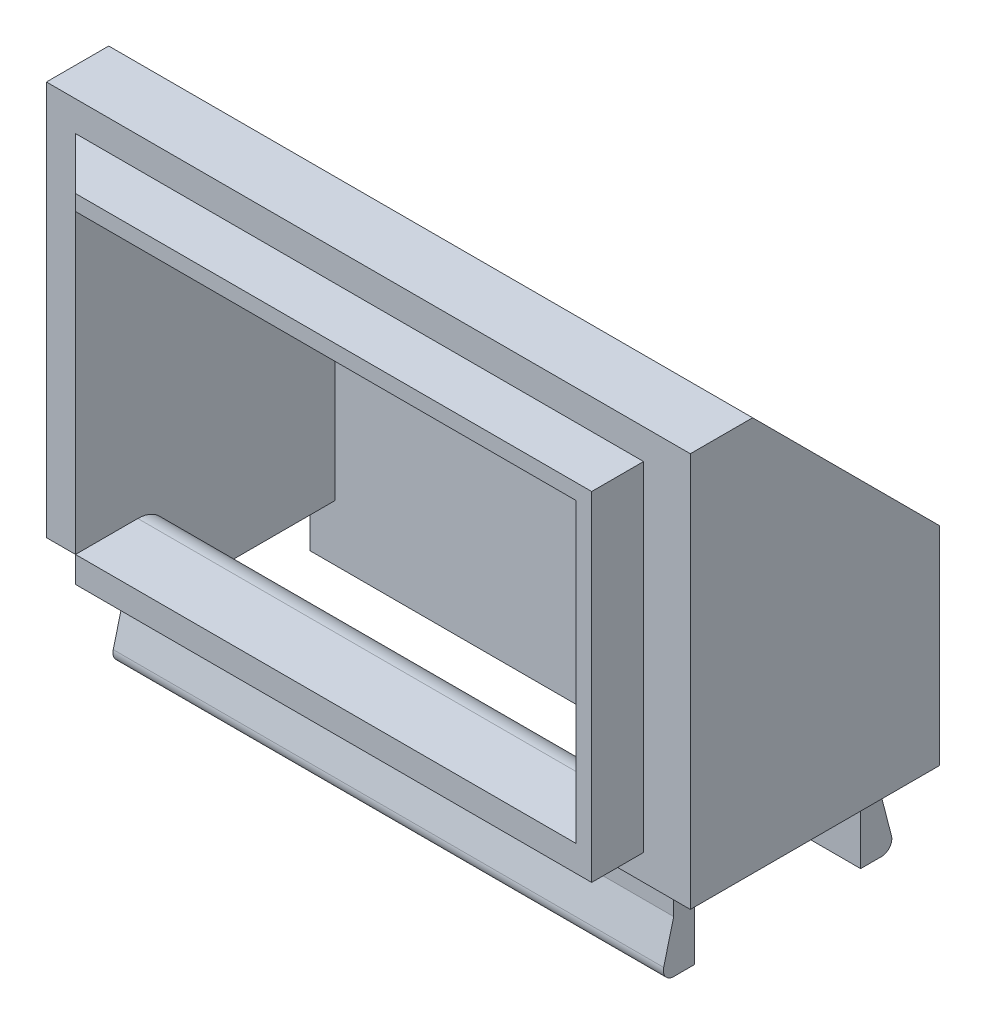
ISO-10303-21;
HEADER;
FILE_DESCRIPTION(('STEP AP214'),'2;1');
FILE_NAME('part.step','',(''),(''),'','','');
FILE_SCHEMA(('AUTOMOTIVE_DESIGN { 1 0 10303 214 1 1 1 1 }'));
ENDSEC;
DATA;
#1=APPLICATION_CONTEXT('core data for automotive mechanical design processes');
#2=APPLICATION_PROTOCOL_DEFINITION('international standard','automotive_design',2000,#1);
#3=PRODUCT_CONTEXT('',#1,'mechanical');
#4=PRODUCT('Part','Part','',(#3));
#5=PRODUCT_RELATED_PRODUCT_CATEGORY('part','',(#4));
#6=PRODUCT_DEFINITION_FORMATION('','',#4);
#7=PRODUCT_DEFINITION_CONTEXT('part definition',#1,'design');
#8=PRODUCT_DEFINITION('design','',#6,#7);
#9=PRODUCT_DEFINITION_SHAPE('','',#8);
#10=(LENGTH_UNIT() NAMED_UNIT(*) SI_UNIT(.MILLI.,.METRE.));
#11=(NAMED_UNIT(*) PLANE_ANGLE_UNIT() SI_UNIT($,.RADIAN.));
#12=(NAMED_UNIT(*) SI_UNIT($,.STERADIAN.) SOLID_ANGLE_UNIT());
#13=UNCERTAINTY_MEASURE_WITH_UNIT(LENGTH_MEASURE(1.E-05),#10,'distance_accuracy_value','');
#14=(GEOMETRIC_REPRESENTATION_CONTEXT(3) GLOBAL_UNCERTAINTY_ASSIGNED_CONTEXT((#13)) GLOBAL_UNIT_ASSIGNED_CONTEXT((#10,
#11,#12)) REPRESENTATION_CONTEXT('',''));
#15=CARTESIAN_POINT('',(0.,0.,0.));
#16=DIRECTION('',(0.,0.,1.));
#17=DIRECTION('',(1.,0.,0.));
#18=AXIS2_PLACEMENT_3D('',#15,#16,#17);
#19=CARTESIAN_POINT('',(-15.5,19.,6.));
#20=DIRECTION('',(0.,0.,-1.));
#21=DIRECTION('',(-1.,0.,0.));
#22=AXIS2_PLACEMENT_3D('',#19,#20,#21);
#23=PLANE('',#22);
#24=DIRECTION('',(1.,0.,0.));
#25=VECTOR('',#24,1.);
#26=CARTESIAN_POINT('',(-15.5,0.,6.));
#27=LINE('',#26,#25);
#28=CARTESIAN_POINT('',(-15.5,0.,6.));
#29=VERTEX_POINT('',#28);
#30=CARTESIAN_POINT('',(15.5,0.,6.));
#31=VERTEX_POINT('',#30);
#32=EDGE_CURVE('E438',#29,#31,#27,.T.);
#33=ORIENTED_EDGE('',*,*,#32,.T.);
#34=DIRECTION('',(0.,-1.,0.));
#35=VECTOR('',#34,1.);
#36=CARTESIAN_POINT('',(15.5,19.,6.));
#37=LINE('',#36,#35);
#38=CARTESIAN_POINT('',(15.5,19.,6.));
#39=VERTEX_POINT('',#38);
#40=EDGE_CURVE('E442',#39,#31,#37,.T.);
#41=ORIENTED_EDGE('',*,*,#40,.F.);
#42=DIRECTION('',(1.,0.,0.));
#43=VECTOR('',#42,1.);
#44=CARTESIAN_POINT('',(-15.5,19.,6.));
#45=LINE('',#44,#43);
#46=CARTESIAN_POINT('',(-15.5,19.,6.));
#47=VERTEX_POINT('',#46);
#48=EDGE_CURVE('E440',#47,#39,#45,.T.);
#49=ORIENTED_EDGE('',*,*,#48,.F.);
#50=DIRECTION('',(0.,-1.,0.));
#51=VECTOR('',#50,1.);
#52=CARTESIAN_POINT('',(-15.5,19.,6.));
#53=LINE('',#52,#51);
#54=EDGE_CURVE('E453',#47,#29,#53,.T.);
#55=ORIENTED_EDGE('',*,*,#54,.T.);
#56=EDGE_LOOP('',(#33,#41,#49,#55));
#57=FACE_BOUND('',#56,.T.);
#58=DIRECTION('',(0.,-1.,0.));
#59=VECTOR('',#58,1.);
#60=CARTESIAN_POINT('',(-14.1,17.55,6.));
#61=LINE('',#60,#59);
#62=CARTESIAN_POINT('',(-14.1,17.55,6.));
#63=VERTEX_POINT('',#62);
#64=CARTESIAN_POINT('',(-14.1,1.25,6.));
#65=VERTEX_POINT('',#64);
#66=EDGE_CURVE('E306',#63,#65,#61,.T.);
#67=ORIENTED_EDGE('',*,*,#66,.F.);
#68=DIRECTION('',(-1.,0.,0.));
#69=VECTOR('',#68,1.);
#70=CARTESIAN_POINT('',(-14.1,17.55,6.));
#71=LINE('',#70,#69);
#72=CARTESIAN_POINT('',(13.25,17.55,6.));
#73=VERTEX_POINT('',#72);
#74=EDGE_CURVE('E294',#73,#63,#71,.T.);
#75=ORIENTED_EDGE('',*,*,#74,.F.);
#76=DIRECTION('',(0.,1.,0.));
#77=VECTOR('',#76,1.);
#78=CARTESIAN_POINT('',(13.25,17.55,6.));
#79=LINE('',#78,#77);
#80=CARTESIAN_POINT('',(13.25,1.25,6.));
#81=VERTEX_POINT('',#80);
#82=EDGE_CURVE('E312',#81,#73,#79,.T.);
#83=ORIENTED_EDGE('',*,*,#82,.F.);
#84=DIRECTION('',(1.,0.,0.));
#85=VECTOR('',#84,1.);
#86=CARTESIAN_POINT('',(-14.1,1.25,6.));
#87=LINE('',#86,#85);
#88=EDGE_CURVE('E308',#65,#81,#87,.T.);
#89=ORIENTED_EDGE('',*,*,#88,.F.);
#90=EDGE_LOOP('',(#67,#75,#83,#89));
#91=FACE_BOUND('',#90,.T.);
#92=ADVANCED_FACE('F49',(#57,#91),#23,.F.);
#93=CARTESIAN_POINT('',(0.,0.,0.));
#94=DIRECTION('',(0.,-1.,0.));
#95=DIRECTION('',(0.,0.,-1.));
#96=AXIS2_PLACEMENT_3D('',#93,#94,#95);
#97=PLANE('',#96);
#98=DIRECTION('',(0.,0.,-1.));
#99=VECTOR('',#98,1.);
#100=CARTESIAN_POINT('',(15.5,0.,6.));
#101=LINE('',#100,#99);
#102=CARTESIAN_POINT('',(15.5,0.,-6.));
#103=VERTEX_POINT('',#102);
#104=EDGE_CURVE('E428',#31,#103,#101,.T.);
#105=ORIENTED_EDGE('',*,*,#104,.F.);
#106=ORIENTED_EDGE('',*,*,#32,.F.);
#107=DIRECTION('',(0.,0.,1.));
#108=VECTOR('',#107,1.);
#109=CARTESIAN_POINT('',(-15.5,0.,6.));
#110=LINE('',#109,#108);
#111=CARTESIAN_POINT('',(-15.5,0.,-6.));
#112=VERTEX_POINT('',#111);
#113=EDGE_CURVE('E448',#112,#29,#110,.T.);
#114=ORIENTED_EDGE('',*,*,#113,.F.);
#115=DIRECTION('',(-1.,0.,0.));
#116=VECTOR('',#115,1.);
#117=CARTESIAN_POINT('',(-15.5,0.,-6.));
#118=LINE('',#117,#116);
#119=EDGE_CURVE('E445',#103,#112,#118,.T.);
#120=ORIENTED_EDGE('',*,*,#119,.F.);
#121=EDGE_LOOP('',(#105,#106,#114,#120));
#122=FACE_BOUND('',#121,.T.);
#123=DIRECTION('',(0.,0.,1.));
#124=VECTOR('',#123,1.);
#125=CARTESIAN_POINT('',(13.7,0.,5.));
#126=LINE('',#125,#124);
#127=CARTESIAN_POINT('',(13.7,0.,-5.));
#128=VERTEX_POINT('',#127);
#129=CARTESIAN_POINT('',(13.7,0.,5.));
#130=VERTEX_POINT('',#129);
#131=EDGE_CURVE('E408',#128,#130,#126,.T.);
#132=ORIENTED_EDGE('',*,*,#131,.F.);
#133=DIRECTION('',(1.,0.,0.));
#134=VECTOR('',#133,1.);
#135=CARTESIAN_POINT('',(-12.8,0.,-5.));
#136=LINE('',#135,#134);
#137=CARTESIAN_POINT('',(-12.8,0.,-5.));
#138=VERTEX_POINT('',#137);
#139=EDGE_CURVE('E381',#138,#128,#136,.T.);
#140=ORIENTED_EDGE('',*,*,#139,.F.);
#141=DIRECTION('',(0.,0.,-1.));
#142=VECTOR('',#141,1.);
#143=CARTESIAN_POINT('',(-12.8,0.,5.));
#144=LINE('',#143,#142);
#145=CARTESIAN_POINT('',(-12.8,0.,5.));
#146=VERTEX_POINT('',#145);
#147=EDGE_CURVE('E384',#146,#138,#144,.T.);
#148=ORIENTED_EDGE('',*,*,#147,.F.);
#149=DIRECTION('',(-1.,0.,0.));
#150=VECTOR('',#149,1.);
#151=CARTESIAN_POINT('',(-12.8,0.,5.));
#152=LINE('',#151,#150);
#153=EDGE_CURVE('E398',#130,#146,#152,.T.);
#154=ORIENTED_EDGE('',*,*,#153,.F.);
#155=EDGE_LOOP('',(#132,#140,#148,#154));
#156=FACE_BOUND('',#155,.T.);
#157=ADVANCED_FACE('F500',(#122,#156),#97,.T.);
#158=CARTESIAN_POINT('',(-11.6,16.8,4.));
#159=DIRECTION('',(0.,0.,1.));
#160=DIRECTION('',(1.,0.,0.));
#161=AXIS2_PLACEMENT_3D('',#158,#159,#160);
#162=PLANE('',#161);
#163=DIRECTION('',(0.,-1.,0.));
#164=VECTOR('',#163,1.);
#165=CARTESIAN_POINT('',(-11.6,16.8,4.));
#166=LINE('',#165,#164);
#167=CARTESIAN_POINT('',(-11.6,1.,4.));
#168=VERTEX_POINT('',#167);
#169=CARTESIAN_POINT('',(-11.6,-1.5,4.));
#170=VERTEX_POINT('',#169);
#171=EDGE_CURVE('E426',#168,#170,#166,.T.);
#172=ORIENTED_EDGE('',*,*,#171,.F.);
#173=DIRECTION('',(-1.,0.,0.));
#174=VECTOR('',#173,1.);
#175=CARTESIAN_POINT('',(-11.6,1.,4.));
#176=LINE('',#175,#174);
#177=CARTESIAN_POINT('',(12.5,1.,4.));
#178=VERTEX_POINT('',#177);
#179=EDGE_CURVE('E70',#168,#178,#176,.F.);
#180=ORIENTED_EDGE('',*,*,#179,.T.);
#181=DIRECTION('',(0.,-1.,0.));
#182=VECTOR('',#181,1.);
#183=CARTESIAN_POINT('',(12.5,16.8,4.));
#184=LINE('',#183,#182);
#185=CARTESIAN_POINT('',(12.5,-1.5,4.));
#186=VERTEX_POINT('',#185);
#187=EDGE_CURVE('E429',#178,#186,#184,.T.);
#188=ORIENTED_EDGE('',*,*,#187,.T.);
#189=DIRECTION('',(-1.,0.,0.));
#190=VECTOR('',#189,1.);
#191=CARTESIAN_POINT('',(12.5,-1.5,4.));
#192=LINE('',#191,#190);
#193=CARTESIAN_POINT('',(13.7,-1.5,4.));
#194=VERTEX_POINT('',#193);
#195=EDGE_CURVE('E318',#194,#186,#192,.T.);
#196=ORIENTED_EDGE('',*,*,#195,.F.);
#197=DIRECTION('',(0.,1.,0.));
#198=VECTOR('',#197,1.);
#199=CARTESIAN_POINT('',(13.7,-4.2,4.));
#200=LINE('',#199,#198);
#201=CARTESIAN_POINT('',(13.7,-4.2,4.));
#202=VERTEX_POINT('',#201);
#203=EDGE_CURVE('E416',#202,#194,#200,.T.);
#204=ORIENTED_EDGE('',*,*,#203,.F.);
#205=DIRECTION('',(1.,0.,0.));
#206=VECTOR('',#205,1.);
#207=CARTESIAN_POINT('',(-12.8,-4.2,4.));
#208=LINE('',#207,#206);
#209=CARTESIAN_POINT('',(-12.8,-4.2,4.));
#210=VERTEX_POINT('',#209);
#211=EDGE_CURVE('E397',#210,#202,#208,.T.);
#212=ORIENTED_EDGE('',*,*,#211,.F.);
#213=DIRECTION('',(0.,1.,0.));
#214=VECTOR('',#213,1.);
#215=CARTESIAN_POINT('',(-12.8,-4.2,4.));
#216=LINE('',#215,#214);
#217=CARTESIAN_POINT('',(-12.8,-1.5,4.));
#218=VERTEX_POINT('',#217);
#219=EDGE_CURVE('E248',#210,#218,#216,.T.);
#220=ORIENTED_EDGE('',*,*,#219,.T.);
#221=DIRECTION('',(-1.,0.,0.));
#222=VECTOR('',#221,1.);
#223=CARTESIAN_POINT('',(-11.6,-1.5,4.));
#224=LINE('',#223,#222);
#225=EDGE_CURVE('E333',#170,#218,#224,.T.);
#226=ORIENTED_EDGE('',*,*,#225,.F.);
#227=EDGE_LOOP('',(#172,#180,#188,#196,#204,#212,#220,#226));
#228=FACE_BOUND('',#227,.T.);
#229=ADVANCED_FACE('F503',(#228),#162,.F.);
#230=CARTESIAN_POINT('',(-11.6,16.8,-4.));
#231=DIRECTION('',(0.,0.,-1.));
#232=DIRECTION('',(-1.,0.,0.));
#233=AXIS2_PLACEMENT_3D('',#230,#231,#232);
#234=PLANE('',#233);
#235=DIRECTION('',(1.,0.,0.));
#236=VECTOR('',#235,1.);
#237=CARTESIAN_POINT('',(12.5,-1.5,-4.));
#238=LINE('',#237,#236);
#239=CARTESIAN_POINT('',(12.5,-1.5,-4.));
#240=VERTEX_POINT('',#239);
#241=CARTESIAN_POINT('',(13.7,-1.5,-4.));
#242=VERTEX_POINT('',#241);
#243=EDGE_CURVE('E324',#240,#242,#238,.T.);
#244=ORIENTED_EDGE('',*,*,#243,.F.);
#245=DIRECTION('',(0.,-1.,0.));
#246=VECTOR('',#245,1.);
#247=CARTESIAN_POINT('',(12.5,16.8,-4.));
#248=LINE('',#247,#246);
#249=CARTESIAN_POINT('',(12.5,8.8,-4.));
#250=VERTEX_POINT('',#249);
#251=EDGE_CURVE('E431',#250,#240,#248,.T.);
#252=ORIENTED_EDGE('',*,*,#251,.F.);
#253=DIRECTION('',(-1.,0.,0.));
#254=VECTOR('',#253,1.);
#255=CARTESIAN_POINT('',(-11.6,8.8,-4.));
#256=LINE('',#255,#254);
#257=CARTESIAN_POINT('',(-11.6,8.8,-4.));
#258=VERTEX_POINT('',#257);
#259=EDGE_CURVE('E465',#250,#258,#256,.T.);
#260=ORIENTED_EDGE('',*,*,#259,.T.);
#261=DIRECTION('',(0.,-1.,0.));
#262=VECTOR('',#261,1.);
#263=CARTESIAN_POINT('',(-11.6,16.8,-4.));
#264=LINE('',#263,#262);
#265=CARTESIAN_POINT('',(-11.6,-1.5,-4.));
#266=VERTEX_POINT('',#265);
#267=EDGE_CURVE('E425',#258,#266,#264,.T.);
#268=ORIENTED_EDGE('',*,*,#267,.T.);
#269=DIRECTION('',(1.,0.,0.));
#270=VECTOR('',#269,1.);
#271=CARTESIAN_POINT('',(-11.6,-1.5,-4.));
#272=LINE('',#271,#270);
#273=CARTESIAN_POINT('',(-12.8,-1.5,-4.));
#274=VERTEX_POINT('',#273);
#275=EDGE_CURVE('E337',#274,#266,#272,.T.);
#276=ORIENTED_EDGE('',*,*,#275,.F.);
#277=DIRECTION('',(0.,1.,0.));
#278=VECTOR('',#277,1.);
#279=CARTESIAN_POINT('',(-12.8,-4.2,-4.));
#280=LINE('',#279,#278);
#281=CARTESIAN_POINT('',(-12.8,-4.2,-4.));
#282=VERTEX_POINT('',#281);
#283=EDGE_CURVE('E377',#282,#274,#280,.T.);
#284=ORIENTED_EDGE('',*,*,#283,.F.);
#285=DIRECTION('',(-1.,0.,0.));
#286=VECTOR('',#285,1.);
#287=CARTESIAN_POINT('',(-12.8,-4.2,-4.));
#288=LINE('',#287,#286);
#289=CARTESIAN_POINT('',(13.7,-4.2,-4.));
#290=VERTEX_POINT('',#289);
#291=EDGE_CURVE('E380',#290,#282,#288,.T.);
#292=ORIENTED_EDGE('',*,*,#291,.F.);
#293=DIRECTION('',(0.,1.,0.));
#294=VECTOR('',#293,1.);
#295=CARTESIAN_POINT('',(13.7,-4.2,-4.));
#296=LINE('',#295,#294);
#297=EDGE_CURVE('E375',#290,#242,#296,.T.);
#298=ORIENTED_EDGE('',*,*,#297,.T.);
#299=EDGE_LOOP('',(#244,#252,#260,#268,#276,#284,#292,#298));
#300=FACE_BOUND('',#299,.T.);
#301=ADVANCED_FACE('F547',(#300),#234,.F.);
#302=CARTESIAN_POINT('',(15.5,19.,6.));
#303=DIRECTION('',(-1.,0.,0.));
#304=DIRECTION('',(0.,0.,1.));
#305=AXIS2_PLACEMENT_3D('',#302,#303,#304);
#306=PLANE('',#305);
#307=DIRECTION('',(0.,-1.,0.));
#308=VECTOR('',#307,1.);
#309=CARTESIAN_POINT('',(15.5,19.,-6.));
#310=LINE('',#309,#308);
#311=CARTESIAN_POINT('',(15.5,10.,-6.));
#312=VERTEX_POINT('',#311);
#313=EDGE_CURVE('E458',#312,#103,#310,.T.);
#314=ORIENTED_EDGE('',*,*,#313,.F.);
#315=DIRECTION('',(0.,-0.707106781186548,-0.707106781186548));
#316=VECTOR('',#315,1.);
#317=CARTESIAN_POINT('',(15.5,19.,3.));
#318=LINE('',#317,#316);
#319=CARTESIAN_POINT('',(15.5,19.,3.));
#320=VERTEX_POINT('',#319);
#321=EDGE_CURVE('E277',#312,#320,#318,.F.);
#322=ORIENTED_EDGE('',*,*,#321,.T.);
#323=DIRECTION('',(0.,0.,-1.));
#324=VECTOR('',#323,1.);
#325=CARTESIAN_POINT('',(15.5,19.,6.));
#326=LINE('',#325,#324);
#327=EDGE_CURVE('E434',#39,#320,#326,.T.);
#328=ORIENTED_EDGE('',*,*,#327,.F.);
#329=ORIENTED_EDGE('',*,*,#40,.T.);
#330=ORIENTED_EDGE('',*,*,#104,.T.);
#331=EDGE_LOOP('',(#314,#322,#328,#329,#330));
#332=FACE_BOUND('',#331,.T.);
#333=ADVANCED_FACE('F482',(#332),#306,.F.);
#334=CARTESIAN_POINT('',(-15.5,19.,-6.));
#335=DIRECTION('',(0.,0.,1.));
#336=DIRECTION('',(1.,0.,0.));
#337=AXIS2_PLACEMENT_3D('',#334,#335,#336);
#338=PLANE('',#337);
#339=DIRECTION('',(0.,-1.,0.));
#340=VECTOR('',#339,1.);
#341=CARTESIAN_POINT('',(-15.5,19.,-6.));
#342=LINE('',#341,#340);
#343=CARTESIAN_POINT('',(-15.5,10.,-6.));
#344=VERTEX_POINT('',#343);
#345=EDGE_CURVE('E456',#344,#112,#342,.T.);
#346=ORIENTED_EDGE('',*,*,#345,.F.);
#347=DIRECTION('',(1.,0.,0.));
#348=VECTOR('',#347,1.);
#349=CARTESIAN_POINT('',(-15.5,10.,-6.));
#350=LINE('',#349,#348);
#351=EDGE_CURVE('E280',#344,#312,#350,.T.);
#352=ORIENTED_EDGE('',*,*,#351,.T.);
#353=ORIENTED_EDGE('',*,*,#313,.T.);
#354=ORIENTED_EDGE('',*,*,#119,.T.);
#355=EDGE_LOOP('',(#346,#352,#353,#354));
#356=FACE_BOUND('',#355,.T.);
#357=ADVANCED_FACE('F477',(#356),#338,.F.);
#358=CARTESIAN_POINT('',(-15.5,19.,6.));
#359=DIRECTION('',(1.,0.,0.));
#360=DIRECTION('',(0.,0.,-1.));
#361=AXIS2_PLACEMENT_3D('',#358,#359,#360);
#362=PLANE('',#361);
#363=DIRECTION('',(0.,0.,1.));
#364=VECTOR('',#363,1.);
#365=CARTESIAN_POINT('',(-15.5,19.,6.));
#366=LINE('',#365,#364);
#367=CARTESIAN_POINT('',(-15.5,19.,3.));
#368=VERTEX_POINT('',#367);
#369=EDGE_CURVE('E437',#368,#47,#366,.T.);
#370=ORIENTED_EDGE('',*,*,#369,.F.);
#371=DIRECTION('',(0.,0.707106781186548,0.707106781186548));
#372=VECTOR('',#371,1.);
#373=CARTESIAN_POINT('',(-15.5,19.,3.));
#374=LINE('',#373,#372);
#375=EDGE_CURVE('E472',#368,#344,#374,.F.);
#376=ORIENTED_EDGE('',*,*,#375,.T.);
#377=ORIENTED_EDGE('',*,*,#345,.T.);
#378=ORIENTED_EDGE('',*,*,#113,.T.);
#379=ORIENTED_EDGE('',*,*,#54,.F.);
#380=EDGE_LOOP('',(#370,#376,#377,#378,#379));
#381=FACE_BOUND('',#380,.T.);
#382=ADVANCED_FACE('F492',(#381),#362,.F.);
#383=CARTESIAN_POINT('',(0.,19.,0.));
#384=DIRECTION('',(0.,-1.,0.));
#385=DIRECTION('',(0.,0.,-1.));
#386=AXIS2_PLACEMENT_3D('',#383,#384,#385);
#387=PLANE('',#386);
#388=ORIENTED_EDGE('',*,*,#327,.T.);
#389=DIRECTION('',(-1.,0.,0.));
#390=VECTOR('',#389,1.);
#391=CARTESIAN_POINT('',(0.,19.,3.));
#392=LINE('',#391,#390);
#393=EDGE_CURVE('E469',#320,#368,#392,.T.);
#394=ORIENTED_EDGE('',*,*,#393,.T.);
#395=ORIENTED_EDGE('',*,*,#369,.T.);
#396=ORIENTED_EDGE('',*,*,#48,.T.);
#397=EDGE_LOOP('',(#388,#394,#395,#396));
#398=FACE_BOUND('',#397,.T.);
#399=ADVANCED_FACE('F489',(#398),#387,.F.);
#400=CARTESIAN_POINT('',(-11.6,16.8,4.));
#401=DIRECTION('',(-1.,0.,0.));
#402=DIRECTION('',(0.,0.,1.));
#403=AXIS2_PLACEMENT_3D('',#400,#401,#402);
#404=PLANE('',#403);
#405=ORIENTED_EDGE('',*,*,#267,.F.);
#406=DIRECTION('',(0.,0.707106781186548,0.707106781186548));
#407=VECTOR('',#406,1.);
#408=CARTESIAN_POINT('',(-11.6,16.8,4.));
#409=LINE('',#408,#407);
#410=CARTESIAN_POINT('',(-11.6,16.8,4.));
#411=VERTEX_POINT('',#410);
#412=EDGE_CURVE('E467',#258,#411,#409,.T.);
#413=ORIENTED_EDGE('',*,*,#412,.T.);
#414=DIRECTION('',(0.,0.,-1.));
#415=VECTOR('',#414,1.);
#416=CARTESIAN_POINT('',(-11.6,16.8,4.));
#417=LINE('',#416,#415);
#418=CARTESIAN_POINT('',(-11.6,16.8,8.5));
#419=VERTEX_POINT('',#418);
#420=EDGE_CURVE('E255',#419,#411,#417,.T.);
#421=ORIENTED_EDGE('',*,*,#420,.F.);
#422=DIRECTION('',(0.,-1.,0.));
#423=VECTOR('',#422,1.);
#424=CARTESIAN_POINT('',(-11.6,16.8,8.5));
#425=LINE('',#424,#423);
#426=CARTESIAN_POINT('',(-11.6,2.5,8.5));
#427=VERTEX_POINT('',#426);
#428=EDGE_CURVE('E251',#419,#427,#425,.T.);
#429=ORIENTED_EDGE('',*,*,#428,.T.);
#430=DIRECTION('',(0.,0.,1.));
#431=VECTOR('',#430,1.);
#432=CARTESIAN_POINT('',(-11.6,2.5,-24.0232046704156));
#433=LINE('',#432,#431);
#434=CARTESIAN_POINT('',(-11.6,2.5,5.5));
#435=VERTEX_POINT('',#434);
#436=EDGE_CURVE('E238',#435,#427,#433,.T.);
#437=ORIENTED_EDGE('',*,*,#436,.F.);
#438=CARTESIAN_POINT('',(-11.6,1.,5.5));
#439=DIRECTION('',(-1.,0.,0.));
#440=DIRECTION('',(0.,0.,1.));
#441=AXIS2_PLACEMENT_3D('',#438,#439,#440);
#442=CIRCLE('',#441,1.5);
#443=EDGE_CURVE('E57',#435,#168,#442,.T.);
#444=ORIENTED_EDGE('',*,*,#443,.T.);
#445=ORIENTED_EDGE('',*,*,#171,.T.);
#446=DIRECTION('',(0.,0.,1.));
#447=VECTOR('',#446,1.);
#448=CARTESIAN_POINT('',(-11.6,-1.5,4.));
#449=LINE('',#448,#447);
#450=EDGE_CURVE('E330',#266,#170,#449,.T.);
#451=ORIENTED_EDGE('',*,*,#450,.F.);
#452=EDGE_LOOP('',(#405,#413,#421,#429,#437,#444,#445,#451));
#453=FACE_BOUND('',#452,.T.);
#454=ADVANCED_FACE('F253',(#453),#404,.F.);
#455=CARTESIAN_POINT('',(12.5,16.8,4.));
#456=DIRECTION('',(1.,0.,0.));
#457=DIRECTION('',(0.,0.,-1.));
#458=AXIS2_PLACEMENT_3D('',#455,#456,#457);
#459=PLANE('',#458);
#460=DIRECTION('',(0.,0.,1.));
#461=VECTOR('',#460,1.);
#462=CARTESIAN_POINT('',(12.5,16.8,4.));
#463=LINE('',#462,#461);
#464=CARTESIAN_POINT('',(12.5,16.8,4.));
#465=VERTEX_POINT('',#464);
#466=CARTESIAN_POINT('',(12.5,16.8,8.5));
#467=VERTEX_POINT('',#466);
#468=EDGE_CURVE('E423',#465,#467,#463,.T.);
#469=ORIENTED_EDGE('',*,*,#468,.F.);
#470=DIRECTION('',(0.,-0.707106781186548,-0.707106781186548));
#471=VECTOR('',#470,1.);
#472=CARTESIAN_POINT('',(12.5,16.8,4.));
#473=LINE('',#472,#471);
#474=EDGE_CURVE('E463',#465,#250,#473,.T.);
#475=ORIENTED_EDGE('',*,*,#474,.T.);
#476=ORIENTED_EDGE('',*,*,#251,.T.);
#477=DIRECTION('',(0.,0.,-1.));
#478=VECTOR('',#477,1.);
#479=CARTESIAN_POINT('',(12.5,-1.5,-4.));
#480=LINE('',#479,#478);
#481=EDGE_CURVE('E327',#186,#240,#480,.T.);
#482=ORIENTED_EDGE('',*,*,#481,.F.);
#483=ORIENTED_EDGE('',*,*,#187,.F.);
#484=CARTESIAN_POINT('',(12.5,1.,5.5));
#485=DIRECTION('',(1.,0.,0.));
#486=DIRECTION('',(0.,0.,-1.));
#487=AXIS2_PLACEMENT_3D('',#484,#485,#486);
#488=CIRCLE('',#487,1.5);
#489=CARTESIAN_POINT('',(12.5,2.5,5.5));
#490=VERTEX_POINT('',#489);
#491=EDGE_CURVE('E13',#178,#490,#488,.T.);
#492=ORIENTED_EDGE('',*,*,#491,.T.);
#493=DIRECTION('',(0.,0.,1.));
#494=VECTOR('',#493,1.);
#495=CARTESIAN_POINT('',(12.5,2.5,-24.0232046704156));
#496=LINE('',#495,#494);
#497=CARTESIAN_POINT('',(12.5,2.5,8.5));
#498=VERTEX_POINT('',#497);
#499=EDGE_CURVE('E247',#490,#498,#496,.T.);
#500=ORIENTED_EDGE('',*,*,#499,.T.);
#501=DIRECTION('',(0.,1.,0.));
#502=VECTOR('',#501,1.);
#503=CARTESIAN_POINT('',(12.5,2.5,8.5));
#504=LINE('',#503,#502);
#505=EDGE_CURVE('E269',#498,#467,#504,.T.);
#506=ORIENTED_EDGE('',*,*,#505,.T.);
#507=EDGE_LOOP('',(#469,#475,#476,#482,#483,#492,#500,#506));
#508=FACE_BOUND('',#507,.T.);
#509=ADVANCED_FACE('F651',(#508),#459,.F.);
#510=CARTESIAN_POINT('',(0.,16.8,0.));
#511=DIRECTION('',(0.,-1.,0.));
#512=DIRECTION('',(0.,0.,-1.));
#513=AXIS2_PLACEMENT_3D('',#510,#511,#512);
#514=PLANE('',#513);
#515=ORIENTED_EDGE('',*,*,#420,.T.);
#516=DIRECTION('',(1.,0.,0.));
#517=VECTOR('',#516,1.);
#518=CARTESIAN_POINT('',(0.,16.8,4.));
#519=LINE('',#518,#517);
#520=EDGE_CURVE('E460',#411,#465,#519,.T.);
#521=ORIENTED_EDGE('',*,*,#520,.T.);
#522=ORIENTED_EDGE('',*,*,#468,.T.);
#523=DIRECTION('',(-1.,0.,0.));
#524=VECTOR('',#523,1.);
#525=CARTESIAN_POINT('',(12.5,16.8,8.5));
#526=LINE('',#525,#524);
#527=EDGE_CURVE('E309',#467,#419,#526,.T.);
#528=ORIENTED_EDGE('',*,*,#527,.T.);
#529=EDGE_LOOP('',(#515,#521,#522,#528));
#530=FACE_BOUND('',#529,.T.);
#531=ADVANCED_FACE('F647',(#530),#514,.T.);
#532=CARTESIAN_POINT('',(-11.6,2.5,-24.0232046704156));
#533=DIRECTION('',(0.,-1.,0.));
#534=DIRECTION('',(0.,0.,-1.));
#535=AXIS2_PLACEMENT_3D('',#532,#533,#534);
#536=PLANE('',#535);
#537=ORIENTED_EDGE('',*,*,#499,.F.);
#538=DIRECTION('',(-1.,0.,0.));
#539=VECTOR('',#538,1.);
#540=CARTESIAN_POINT('',(-11.6,2.5,5.5));
#541=LINE('',#540,#539);
#542=EDGE_CURVE('E246',#490,#435,#541,.T.);
#543=ORIENTED_EDGE('',*,*,#542,.T.);
#544=ORIENTED_EDGE('',*,*,#436,.T.);
#545=DIRECTION('',(1.,0.,0.));
#546=VECTOR('',#545,1.);
#547=CARTESIAN_POINT('',(-11.6,2.5,8.5));
#548=LINE('',#547,#546);
#549=EDGE_CURVE('E243',#427,#498,#548,.T.);
#550=ORIENTED_EDGE('',*,*,#549,.T.);
#551=EDGE_LOOP('',(#537,#543,#544,#550));
#552=FACE_BOUND('',#551,.T.);
#553=ADVANCED_FACE('F241',(#552),#536,.F.);
#554=CARTESIAN_POINT('',(0.,16.8,4.));
#555=DIRECTION('',(0.,0.707106781186548,-0.707106781186548));
#556=DIRECTION('',(1.,0.,0.));
#557=AXIS2_PLACEMENT_3D('',#554,#555,#556);
#558=PLANE('',#557);
#559=ORIENTED_EDGE('',*,*,#412,.F.);
#560=ORIENTED_EDGE('',*,*,#259,.F.);
#561=ORIENTED_EDGE('',*,*,#474,.F.);
#562=ORIENTED_EDGE('',*,*,#520,.F.);
#563=EDGE_LOOP('',(#559,#560,#561,#562));
#564=FACE_BOUND('',#563,.T.);
#565=ADVANCED_FACE('F585',(#564),#558,.F.);
#566=CARTESIAN_POINT('',(0.,19.,3.));
#567=DIRECTION('',(0.,-0.707106781186547,0.707106781186547));
#568=DIRECTION('',(-1.,0.,0.));
#569=AXIS2_PLACEMENT_3D('',#566,#567,#568);
#570=PLANE('',#569);
#571=ORIENTED_EDGE('',*,*,#321,.F.);
#572=ORIENTED_EDGE('',*,*,#351,.F.);
#573=ORIENTED_EDGE('',*,*,#375,.F.);
#574=ORIENTED_EDGE('',*,*,#393,.F.);
#575=EDGE_LOOP('',(#571,#572,#573,#574));
#576=FACE_BOUND('',#575,.T.);
#577=ADVANCED_FACE('F486',(#576),#570,.F.);
#578=CARTESIAN_POINT('',(-12.8,-4.2,5.));
#579=DIRECTION('',(1.,0.,0.));
#580=DIRECTION('',(0.,0.,-1.));
#581=AXIS2_PLACEMENT_3D('',#578,#579,#580);
#582=PLANE('',#581);
#583=ORIENTED_EDGE('',*,*,#147,.T.);
#584=DIRECTION('',(0.,1.,0.));
#585=VECTOR('',#584,1.);
#586=CARTESIAN_POINT('',(-12.8,-4.2,-5.));
#587=LINE('',#586,#585);
#588=CARTESIAN_POINT('',(-12.8,-1.7,-5.));
#589=VERTEX_POINT('',#588);
#590=EDGE_CURVE('E360',#589,#138,#587,.T.);
#591=ORIENTED_EDGE('',*,*,#590,.F.);
#592=DIRECTION('',(0.,-0.968245836551854,-0.250000000000001));
#593=VECTOR('',#592,1.);
#594=CARTESIAN_POINT('',(-12.8,-3.575,-5.48412291827593));
#595=LINE('',#594,#593);
#596=CARTESIAN_POINT('',(-12.8,-3.575,-5.48412291827593));
#597=VERTEX_POINT('',#596);
#598=EDGE_CURVE('E340',#589,#597,#595,.T.);
#599=ORIENTED_EDGE('',*,*,#598,.T.);
#600=CARTESIAN_POINT('',(-12.8,-3.7,-5.));
#601=DIRECTION('',(1.,0.,0.));
#602=DIRECTION('',(0.,0.,-1.));
#603=AXIS2_PLACEMENT_3D('',#600,#601,#602);
#604=CIRCLE('',#603,0.5);
#605=CARTESIAN_POINT('',(-12.8,-4.2,-5.));
#606=VERTEX_POINT('',#605);
#607=EDGE_CURVE('E342',#597,#606,#604,.F.);
#608=ORIENTED_EDGE('',*,*,#607,.T.);
#609=DIRECTION('',(0.,0.,-1.));
#610=VECTOR('',#609,1.);
#611=CARTESIAN_POINT('',(-12.8,-4.2,-4.));
#612=LINE('',#611,#610);
#613=EDGE_CURVE('E385',#282,#606,#612,.T.);
#614=ORIENTED_EDGE('',*,*,#613,.F.);
#615=ORIENTED_EDGE('',*,*,#283,.T.);
#616=DIRECTION('',(0.,0.,-1.));
#617=VECTOR('',#616,1.);
#618=CARTESIAN_POINT('',(-12.8,-1.5,4.));
#619=LINE('',#618,#617);
#620=EDGE_CURVE('E335',#218,#274,#619,.T.);
#621=ORIENTED_EDGE('',*,*,#620,.F.);
#622=ORIENTED_EDGE('',*,*,#219,.F.);
#623=DIRECTION('',(0.,0.,-1.));
#624=VECTOR('',#623,1.);
#625=CARTESIAN_POINT('',(-12.8,-4.2,5.));
#626=LINE('',#625,#624);
#627=CARTESIAN_POINT('',(-12.8,-4.2,5.));
#628=VERTEX_POINT('',#627);
#629=EDGE_CURVE('E394',#628,#210,#626,.T.);
#630=ORIENTED_EDGE('',*,*,#629,.F.);
#631=CARTESIAN_POINT('',(-12.8,-3.7,5.));
#632=DIRECTION('',(1.,0.,0.));
#633=DIRECTION('',(0.,0.,-1.));
#634=AXIS2_PLACEMENT_3D('',#631,#632,#633);
#635=CIRCLE('',#634,0.5);
#636=CARTESIAN_POINT('',(-12.8,-3.575,5.48412291827593));
#637=VERTEX_POINT('',#636);
#638=EDGE_CURVE('E357',#628,#637,#635,.F.);
#639=ORIENTED_EDGE('',*,*,#638,.T.);
#640=DIRECTION('',(0.,0.968245836551854,-0.25));
#641=VECTOR('',#640,1.);
#642=CARTESIAN_POINT('',(-12.8,-3.575,5.48412291827593));
#643=LINE('',#642,#641);
#644=CARTESIAN_POINT('',(-12.8,-1.7,5.));
#645=VERTEX_POINT('',#644);
#646=EDGE_CURVE('E355',#637,#645,#643,.T.);
#647=ORIENTED_EDGE('',*,*,#646,.T.);
#648=DIRECTION('',(0.,1.,0.));
#649=VECTOR('',#648,1.);
#650=CARTESIAN_POINT('',(-12.8,-4.2,5.));
#651=LINE('',#650,#649);
#652=EDGE_CURVE('E406',#645,#146,#651,.T.);
#653=ORIENTED_EDGE('',*,*,#652,.T.);
#654=EDGE_LOOP('',(#583,#591,#599,#608,#614,#615,#621,#622,#630,#639,#647,#653));
#655=FACE_BOUND('',#654,.T.);
#656=ADVANCED_FACE('F518',(#655),#582,.F.);
#657=CARTESIAN_POINT('',(13.7,-4.2,5.));
#658=DIRECTION('',(-1.,0.,0.));
#659=DIRECTION('',(0.,0.,1.));
#660=AXIS2_PLACEMENT_3D('',#657,#658,#659);
#661=PLANE('',#660);
#662=ORIENTED_EDGE('',*,*,#131,.T.);
#663=DIRECTION('',(0.,1.,0.));
#664=VECTOR('',#663,1.);
#665=CARTESIAN_POINT('',(13.7,-4.2,5.));
#666=LINE('',#665,#664);
#667=CARTESIAN_POINT('',(13.7,-1.7,5.));
#668=VERTEX_POINT('',#667);
#669=EDGE_CURVE('E414',#668,#130,#666,.T.);
#670=ORIENTED_EDGE('',*,*,#669,.F.);
#671=DIRECTION('',(0.,-0.968245836551854,0.25));
#672=VECTOR('',#671,1.);
#673=CARTESIAN_POINT('',(13.7,-3.575,5.48412291827593));
#674=LINE('',#673,#672);
#675=CARTESIAN_POINT('',(13.7,-3.575,5.48412291827593));
#676=VERTEX_POINT('',#675);
#677=EDGE_CURVE('E363',#668,#676,#674,.T.);
#678=ORIENTED_EDGE('',*,*,#677,.T.);
#679=CARTESIAN_POINT('',(13.7,-3.7,5.));
#680=DIRECTION('',(1.,0.,0.));
#681=DIRECTION('',(0.,0.,-1.));
#682=AXIS2_PLACEMENT_3D('',#679,#680,#681);
#683=CIRCLE('',#682,0.5);
#684=CARTESIAN_POINT('',(13.7,-4.2,5.));
#685=VERTEX_POINT('',#684);
#686=EDGE_CURVE('E353',#676,#685,#683,.T.);
#687=ORIENTED_EDGE('',*,*,#686,.T.);
#688=DIRECTION('',(0.,0.,1.));
#689=VECTOR('',#688,1.);
#690=CARTESIAN_POINT('',(13.7,-4.2,5.));
#691=LINE('',#690,#689);
#692=EDGE_CURVE('E400',#202,#685,#691,.T.);
#693=ORIENTED_EDGE('',*,*,#692,.F.);
#694=ORIENTED_EDGE('',*,*,#203,.T.);
#695=DIRECTION('',(0.,0.,1.));
#696=VECTOR('',#695,1.);
#697=CARTESIAN_POINT('',(13.7,-1.5,-4.));
#698=LINE('',#697,#696);
#699=EDGE_CURVE('E321',#242,#194,#698,.T.);
#700=ORIENTED_EDGE('',*,*,#699,.F.);
#701=ORIENTED_EDGE('',*,*,#297,.F.);
#702=DIRECTION('',(0.,0.,1.));
#703=VECTOR('',#702,1.);
#704=CARTESIAN_POINT('',(13.7,-4.2,-4.));
#705=LINE('',#704,#703);
#706=CARTESIAN_POINT('',(13.7,-4.2,-5.));
#707=VERTEX_POINT('',#706);
#708=EDGE_CURVE('E387',#707,#290,#705,.T.);
#709=ORIENTED_EDGE('',*,*,#708,.F.);
#710=CARTESIAN_POINT('',(13.7,-3.7,-5.));
#711=DIRECTION('',(1.,0.,0.));
#712=DIRECTION('',(0.,0.,-1.));
#713=AXIS2_PLACEMENT_3D('',#710,#711,#712);
#714=CIRCLE('',#713,0.5);
#715=CARTESIAN_POINT('',(13.7,-3.575,-5.48412291827593));
#716=VERTEX_POINT('',#715);
#717=EDGE_CURVE('E350',#707,#716,#714,.T.);
#718=ORIENTED_EDGE('',*,*,#717,.T.);
#719=DIRECTION('',(0.,0.968245836551854,0.250000000000001));
#720=VECTOR('',#719,1.);
#721=CARTESIAN_POINT('',(13.7,-3.575,-5.48412291827593));
#722=LINE('',#721,#720);
#723=CARTESIAN_POINT('',(13.7,-1.7,-5.));
#724=VERTEX_POINT('',#723);
#725=EDGE_CURVE('E345',#716,#724,#722,.T.);
#726=ORIENTED_EDGE('',*,*,#725,.T.);
#727=DIRECTION('',(0.,1.,0.));
#728=VECTOR('',#727,1.);
#729=CARTESIAN_POINT('',(13.7,-4.2,-5.));
#730=LINE('',#729,#728);
#731=EDGE_CURVE('E372',#724,#128,#730,.T.);
#732=ORIENTED_EDGE('',*,*,#731,.T.);
#733=EDGE_LOOP('',(#662,#670,#678,#687,#693,#694,#700,#701,#709,#718,#726,#732));
#734=FACE_BOUND('',#733,.T.);
#735=ADVANCED_FACE('F511',(#734),#661,.F.);
#736=CARTESIAN_POINT('',(-12.8,-4.2,5.));
#737=DIRECTION('',(0.,0.,-1.));
#738=DIRECTION('',(-1.,0.,0.));
#739=AXIS2_PLACEMENT_3D('',#736,#737,#738);
#740=PLANE('',#739);
#741=ORIENTED_EDGE('',*,*,#652,.F.);
#742=DIRECTION('',(1.,0.,0.));
#743=VECTOR('',#742,1.);
#744=CARTESIAN_POINT('',(-15.3495097567964,-1.7,5.));
#745=LINE('',#744,#743);
#746=EDGE_CURVE('E366',#645,#668,#745,.T.);
#747=ORIENTED_EDGE('',*,*,#746,.T.);
#748=ORIENTED_EDGE('',*,*,#669,.T.);
#749=ORIENTED_EDGE('',*,*,#153,.T.);
#750=EDGE_LOOP('',(#741,#747,#748,#749));
#751=FACE_BOUND('',#750,.T.);
#752=ADVANCED_FACE('F522',(#751),#740,.F.);
#753=CARTESIAN_POINT('',(0.,-4.2,0.));
#754=DIRECTION('',(0.,-1.,0.));
#755=DIRECTION('',(0.,0.,-1.));
#756=AXIS2_PLACEMENT_3D('',#753,#754,#755);
#757=PLANE('',#756);
#758=ORIENTED_EDGE('',*,*,#629,.T.);
#759=ORIENTED_EDGE('',*,*,#211,.T.);
#760=ORIENTED_EDGE('',*,*,#692,.T.);
#761=DIRECTION('',(-1.,0.,0.));
#762=VECTOR('',#761,1.);
#763=CARTESIAN_POINT('',(-12.8,-4.2,5.));
#764=LINE('',#763,#762);
#765=EDGE_CURVE('E403',#685,#628,#764,.T.);
#766=ORIENTED_EDGE('',*,*,#765,.T.);
#767=EDGE_LOOP('',(#758,#759,#760,#766));
#768=FACE_BOUND('',#767,.T.);
#769=ADVANCED_FACE('F534',(#768),#757,.T.);
#770=CARTESIAN_POINT('',(-12.8,-4.2,-5.));
#771=DIRECTION('',(0.,0.,1.));
#772=DIRECTION('',(1.,0.,0.));
#773=AXIS2_PLACEMENT_3D('',#770,#771,#772);
#774=PLANE('',#773);
#775=ORIENTED_EDGE('',*,*,#731,.F.);
#776=DIRECTION('',(1.,0.,0.));
#777=VECTOR('',#776,1.);
#778=CARTESIAN_POINT('',(-15.3495097567964,-1.7,-5.));
#779=LINE('',#778,#777);
#780=EDGE_CURVE('E346',#589,#724,#779,.T.);
#781=ORIENTED_EDGE('',*,*,#780,.F.);
#782=ORIENTED_EDGE('',*,*,#590,.T.);
#783=ORIENTED_EDGE('',*,*,#139,.T.);
#784=EDGE_LOOP('',(#775,#781,#782,#783));
#785=FACE_BOUND('',#784,.T.);
#786=ADVANCED_FACE('F515',(#785),#774,.F.);
#787=CARTESIAN_POINT('',(0.,-4.2,0.));
#788=DIRECTION('',(0.,-1.,0.));
#789=DIRECTION('',(0.,0.,-1.));
#790=AXIS2_PLACEMENT_3D('',#787,#788,#789);
#791=PLANE('',#790);
#792=ORIENTED_EDGE('',*,*,#613,.T.);
#793=DIRECTION('',(1.,0.,0.));
#794=VECTOR('',#793,1.);
#795=CARTESIAN_POINT('',(-12.8,-4.2,-5.));
#796=LINE('',#795,#794);
#797=EDGE_CURVE('E389',#606,#707,#796,.T.);
#798=ORIENTED_EDGE('',*,*,#797,.T.);
#799=ORIENTED_EDGE('',*,*,#708,.T.);
#800=ORIENTED_EDGE('',*,*,#291,.T.);
#801=EDGE_LOOP('',(#792,#798,#799,#800));
#802=FACE_BOUND('',#801,.T.);
#803=ADVANCED_FACE('F553',(#802),#791,.T.);
#804=CARTESIAN_POINT('',(-15.3495097567964,-3.7,5.));
#805=DIRECTION('',(1.,0.,0.));
#806=DIRECTION('',(0.,0.,-1.));
#807=AXIS2_PLACEMENT_3D('',#804,#805,#806);
#808=CYLINDRICAL_SURFACE('',#807,0.5);
#809=ORIENTED_EDGE('',*,*,#638,.F.);
#810=ORIENTED_EDGE('',*,*,#765,.F.);
#811=ORIENTED_EDGE('',*,*,#686,.F.);
#812=DIRECTION('',(1.,0.,0.));
#813=VECTOR('',#812,1.);
#814=CARTESIAN_POINT('',(-15.3495097567964,-3.575,5.48412291827593));
#815=LINE('',#814,#813);
#816=EDGE_CURVE('E358',#637,#676,#815,.T.);
#817=ORIENTED_EDGE('',*,*,#816,.F.);
#818=EDGE_LOOP('',(#809,#810,#811,#817));
#819=FACE_BOUND('',#818,.T.);
#820=ADVANCED_FACE('F531',(#819),#808,.T.);
#821=CARTESIAN_POINT('',(-15.3495097567964,-3.575,5.48412291827593));
#822=DIRECTION('',(0.,0.25,0.968245836551854));
#823=DIRECTION('',(0.,-0.968245836551854,0.25));
#824=AXIS2_PLACEMENT_3D('',#821,#822,#823);
#825=PLANE('',#824);
#826=ORIENTED_EDGE('',*,*,#646,.F.);
#827=ORIENTED_EDGE('',*,*,#816,.T.);
#828=ORIENTED_EDGE('',*,*,#677,.F.);
#829=ORIENTED_EDGE('',*,*,#746,.F.);
#830=EDGE_LOOP('',(#826,#827,#828,#829));
#831=FACE_BOUND('',#830,.T.);
#832=ADVANCED_FACE('F528',(#831),#825,.T.);
#833=CARTESIAN_POINT('',(-15.3495097567964,-3.7,-5.));
#834=DIRECTION('',(1.,0.,0.));
#835=DIRECTION('',(0.,0.,-1.));
#836=AXIS2_PLACEMENT_3D('',#833,#834,#835);
#837=CYLINDRICAL_SURFACE('',#836,0.5);
#838=ORIENTED_EDGE('',*,*,#607,.F.);
#839=DIRECTION('',(1.,0.,0.));
#840=VECTOR('',#839,1.);
#841=CARTESIAN_POINT('',(-15.3495097567964,-3.575,-5.48412291827593));
#842=LINE('',#841,#840);
#843=EDGE_CURVE('E343',#597,#716,#842,.T.);
#844=ORIENTED_EDGE('',*,*,#843,.T.);
#845=ORIENTED_EDGE('',*,*,#717,.F.);
#846=ORIENTED_EDGE('',*,*,#797,.F.);
#847=EDGE_LOOP('',(#838,#844,#845,#846));
#848=FACE_BOUND('',#847,.T.);
#849=ADVANCED_FACE('F557',(#848),#837,.T.);
#850=CARTESIAN_POINT('',(-15.3495097567964,-3.575,-5.48412291827593));
#851=DIRECTION('',(0.,0.250000000000001,-0.968245836551854));
#852=DIRECTION('',(0.,0.968245836551854,0.250000000000001));
#853=AXIS2_PLACEMENT_3D('',#850,#851,#852);
#854=PLANE('',#853);
#855=ORIENTED_EDGE('',*,*,#598,.F.);
#856=ORIENTED_EDGE('',*,*,#780,.T.);
#857=ORIENTED_EDGE('',*,*,#725,.F.);
#858=ORIENTED_EDGE('',*,*,#843,.F.);
#859=EDGE_LOOP('',(#855,#856,#857,#858));
#860=FACE_BOUND('',#859,.T.);
#861=ADVANCED_FACE('F560',(#860),#854,.T.);
#862=CARTESIAN_POINT('',(0.,-1.5,0.));
#863=DIRECTION('',(0.,1.,0.));
#864=DIRECTION('',(0.,0.,1.));
#865=AXIS2_PLACEMENT_3D('',#862,#863,#864);
#866=PLANE('',#865);
#867=ORIENTED_EDGE('',*,*,#450,.T.);
#868=ORIENTED_EDGE('',*,*,#225,.T.);
#869=ORIENTED_EDGE('',*,*,#620,.T.);
#870=ORIENTED_EDGE('',*,*,#275,.T.);
#871=EDGE_LOOP('',(#867,#868,#869,#870));
#872=FACE_BOUND('',#871,.T.);
#873=ADVANCED_FACE('F562',(#872),#866,.F.);
#874=CARTESIAN_POINT('',(0.,-1.5,0.));
#875=DIRECTION('',(0.,1.,0.));
#876=DIRECTION('',(0.,0.,1.));
#877=AXIS2_PLACEMENT_3D('',#874,#875,#876);
#878=PLANE('',#877);
#879=ORIENTED_EDGE('',*,*,#481,.T.);
#880=ORIENTED_EDGE('',*,*,#243,.T.);
#881=ORIENTED_EDGE('',*,*,#699,.T.);
#882=ORIENTED_EDGE('',*,*,#195,.T.);
#883=EDGE_LOOP('',(#879,#880,#881,#882));
#884=FACE_BOUND('',#883,.T.);
#885=ADVANCED_FACE('F542',(#884),#878,.F.);
#886=CARTESIAN_POINT('',(0.,0.,8.5));
#887=DIRECTION('',(0.,0.,1.));
#888=DIRECTION('',(1.,0.,0.));
#889=AXIS2_PLACEMENT_3D('',#886,#887,#888);
#890=PLANE('',#889);
#891=DIRECTION('',(-1.,0.,0.));
#892=VECTOR('',#891,1.);
#893=CARTESIAN_POINT('',(-14.1,17.55,8.5));
#894=LINE('',#893,#892);
#895=CARTESIAN_POINT('',(13.25,17.55,8.5));
#896=VERTEX_POINT('',#895);
#897=CARTESIAN_POINT('',(-11.6,17.55,8.5));
#898=VERTEX_POINT('',#897);
#899=EDGE_CURVE('E293',#896,#898,#894,.T.);
#900=ORIENTED_EDGE('',*,*,#899,.T.);
#901=DIRECTION('',(0.,-1.,0.));
#902=VECTOR('',#901,1.);
#903=CARTESIAN_POINT('',(-11.6,1.25,8.5));
#904=LINE('',#903,#902);
#905=EDGE_CURVE('E276',#898,#419,#904,.T.);
#906=ORIENTED_EDGE('',*,*,#905,.T.);
#907=ORIENTED_EDGE('',*,*,#527,.F.);
#908=ORIENTED_EDGE('',*,*,#505,.F.);
#909=ORIENTED_EDGE('',*,*,#549,.F.);
#910=DIRECTION('',(0.,-1.,0.));
#911=VECTOR('',#910,1.);
#912=CARTESIAN_POINT('',(-11.6,1.25,8.5));
#913=LINE('',#912,#911);
#914=CARTESIAN_POINT('',(-11.6,1.25,8.5));
#915=VERTEX_POINT('',#914);
#916=EDGE_CURVE('E265',#427,#915,#913,.T.);
#917=ORIENTED_EDGE('',*,*,#916,.T.);
#918=DIRECTION('',(1.,0.,0.));
#919=VECTOR('',#918,1.);
#920=CARTESIAN_POINT('',(-14.1,1.25,8.5));
#921=LINE('',#920,#919);
#922=CARTESIAN_POINT('',(13.25,1.25,8.5));
#923=VERTEX_POINT('',#922);
#924=EDGE_CURVE('E302',#915,#923,#921,.T.);
#925=ORIENTED_EDGE('',*,*,#924,.T.);
#926=DIRECTION('',(0.,1.,0.));
#927=VECTOR('',#926,1.);
#928=CARTESIAN_POINT('',(13.25,17.55,8.5));
#929=LINE('',#928,#927);
#930=EDGE_CURVE('E296',#923,#896,#929,.T.);
#931=ORIENTED_EDGE('',*,*,#930,.T.);
#932=EDGE_LOOP('',(#900,#906,#907,#908,#909,#917,#925,#931));
#933=FACE_BOUND('',#932,.T.);
#934=ADVANCED_FACE('F264',(#933),#890,.T.);
#935=CARTESIAN_POINT('',(-14.1,1.25,8.5));
#936=DIRECTION('',(0.,1.,0.));
#937=DIRECTION('',(0.,0.,1.));
#938=AXIS2_PLACEMENT_3D('',#935,#936,#937);
#939=PLANE('',#938);
#940=ORIENTED_EDGE('',*,*,#924,.F.);
#941=DIRECTION('',(-0.707106781186546,0.,-0.707106781186549));
#942=VECTOR('',#941,1.);
#943=CARTESIAN_POINT('',(-11.6,1.25,8.5));
#944=LINE('',#943,#942);
#945=EDGE_CURVE('E275',#915,#65,#944,.T.);
#946=ORIENTED_EDGE('',*,*,#945,.T.);
#947=ORIENTED_EDGE('',*,*,#88,.T.);
#948=DIRECTION('',(0.,0.,-1.));
#949=VECTOR('',#948,1.);
#950=CARTESIAN_POINT('',(13.25,1.25,8.5));
#951=LINE('',#950,#949);
#952=EDGE_CURVE('E300',#923,#81,#951,.T.);
#953=ORIENTED_EDGE('',*,*,#952,.F.);
#954=EDGE_LOOP('',(#940,#946,#947,#953));
#955=FACE_BOUND('',#954,.T.);
#956=ADVANCED_FACE('F609',(#955),#939,.F.);
#957=CARTESIAN_POINT('',(13.25,17.55,8.5));
#958=DIRECTION('',(-1.,0.,0.));
#959=DIRECTION('',(0.,-1.,0.));
#960=AXIS2_PLACEMENT_3D('',#957,#958,#959);
#961=PLANE('',#960);
#962=ORIENTED_EDGE('',*,*,#82,.T.);
#963=DIRECTION('',(0.,0.,-1.));
#964=VECTOR('',#963,1.);
#965=CARTESIAN_POINT('',(13.25,17.55,8.5));
#966=LINE('',#965,#964);
#967=EDGE_CURVE('E298',#896,#73,#966,.T.);
#968=ORIENTED_EDGE('',*,*,#967,.F.);
#969=ORIENTED_EDGE('',*,*,#930,.F.);
#970=ORIENTED_EDGE('',*,*,#952,.T.);
#971=EDGE_LOOP('',(#962,#968,#969,#970));
#972=FACE_BOUND('',#971,.T.);
#973=ADVANCED_FACE('F604',(#972),#961,.F.);
#974=CARTESIAN_POINT('',(-14.1,17.55,8.5));
#975=DIRECTION('',(0.,-1.,0.));
#976=DIRECTION('',(0.,0.,-1.));
#977=AXIS2_PLACEMENT_3D('',#974,#975,#976);
#978=PLANE('',#977);
#979=ORIENTED_EDGE('',*,*,#74,.T.);
#980=DIRECTION('',(0.707106781186546,0.,0.707106781186549));
#981=VECTOR('',#980,1.);
#982=CARTESIAN_POINT('',(-11.6,17.55,8.5));
#983=LINE('',#982,#981);
#984=EDGE_CURVE('E285',#63,#898,#983,.T.);
#985=ORIENTED_EDGE('',*,*,#984,.T.);
#986=ORIENTED_EDGE('',*,*,#899,.F.);
#987=ORIENTED_EDGE('',*,*,#967,.T.);
#988=EDGE_LOOP('',(#979,#985,#986,#987));
#989=FACE_BOUND('',#988,.T.);
#990=ADVANCED_FACE('F291',(#989),#978,.F.);
#991=CARTESIAN_POINT('',(-11.6,0.,8.5));
#992=DIRECTION('',(-0.707106781186549,0.,0.707106781186546));
#993=DIRECTION('',(0.,1.,0.));
#994=AXIS2_PLACEMENT_3D('',#991,#992,#993);
#995=PLANE('',#994);
#996=ORIENTED_EDGE('',*,*,#984,.F.);
#997=ORIENTED_EDGE('',*,*,#66,.T.);
#998=ORIENTED_EDGE('',*,*,#945,.F.);
#999=ORIENTED_EDGE('',*,*,#916,.F.);
#1000=ORIENTED_EDGE('',*,*,#428,.F.);
#1001=ORIENTED_EDGE('',*,*,#905,.F.);
#1002=EDGE_LOOP('',(#996,#997,#998,#999,#1000,#1001));
#1003=FACE_BOUND('',#1002,.T.);
#1004=ADVANCED_FACE('F273',(#1003),#995,.T.);
#1005=CARTESIAN_POINT('',(-11.6,1.,5.5));
#1006=DIRECTION('',(-1.,0.,0.));
#1007=DIRECTION('',(0.,0.,1.));
#1008=AXIS2_PLACEMENT_3D('',#1005,#1006,#1007);
#1009=CYLINDRICAL_SURFACE('',#1008,1.5);
#1010=ORIENTED_EDGE('',*,*,#491,.F.);
#1011=ORIENTED_EDGE('',*,*,#179,.F.);
#1012=ORIENTED_EDGE('',*,*,#443,.F.);
#1013=ORIENTED_EDGE('',*,*,#542,.F.);
#1014=EDGE_LOOP('',(#1010,#1011,#1012,#1013));
#1015=FACE_BOUND('',#1014,.T.);
#1016=ADVANCED_FACE('F51',(#1015),#1009,.T.);
#1017=CLOSED_SHELL('',(#92,#157,#229,#301,#333,#357,#382,#399,#454,#509,#531,#553,#565,#577,
#656,#735,#752,#769,#786,#803,#820,#832,#849,#861,#873,#885,#934,#956,#973,#990,#1004,#1016));
#1018=MANIFOLD_SOLID_BREP('B2',#1017);
#1019=ADVANCED_BREP_SHAPE_REPRESENTATION('',(#18,#1018),#14);
#1020=SHAPE_DEFINITION_REPRESENTATION(#9,#1019);
ENDSEC;
END-ISO-10303-21;
